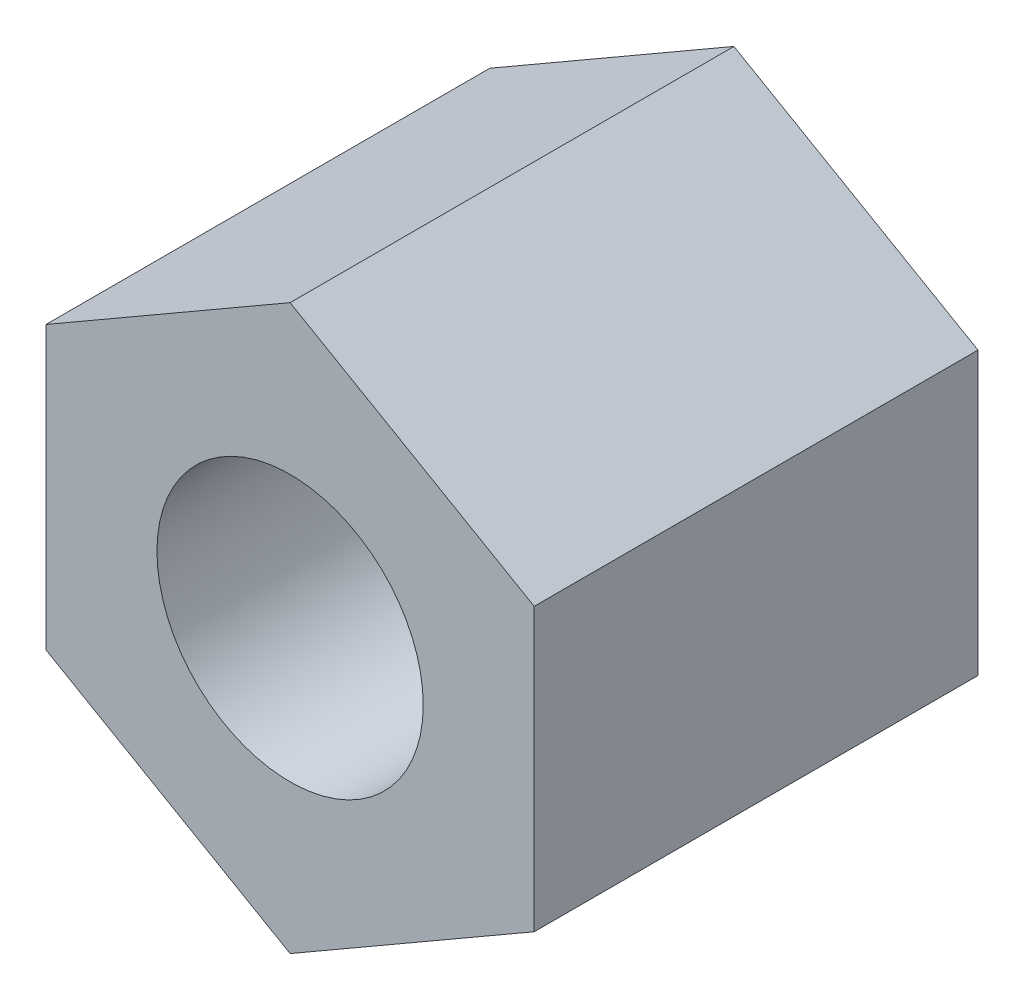
ISO-10303-21;
HEADER;
FILE_DESCRIPTION(('STEP AP214'),'2;1');
FILE_NAME('part.step','',(''),(''),'','','');
FILE_SCHEMA(('AUTOMOTIVE_DESIGN { 1 0 10303 214 1 1 1 1 }'));
ENDSEC;
DATA;
#1=APPLICATION_CONTEXT('core data for automotive mechanical design processes');
#2=APPLICATION_PROTOCOL_DEFINITION('international standard','automotive_design',2000,#1);
#3=PRODUCT_CONTEXT('',#1,'mechanical');
#4=PRODUCT('Part','Part','',(#3));
#5=PRODUCT_RELATED_PRODUCT_CATEGORY('part','',(#4));
#6=PRODUCT_DEFINITION_FORMATION('','',#4);
#7=PRODUCT_DEFINITION_CONTEXT('part definition',#1,'design');
#8=PRODUCT_DEFINITION('design','',#6,#7);
#9=PRODUCT_DEFINITION_SHAPE('','',#8);
#10=(LENGTH_UNIT() NAMED_UNIT(*) SI_UNIT(.MILLI.,.METRE.));
#11=(NAMED_UNIT(*) PLANE_ANGLE_UNIT() SI_UNIT($,.RADIAN.));
#12=(NAMED_UNIT(*) SI_UNIT($,.STERADIAN.) SOLID_ANGLE_UNIT());
#13=UNCERTAINTY_MEASURE_WITH_UNIT(LENGTH_MEASURE(1.E-05),#10,'distance_accuracy_value','');
#14=(GEOMETRIC_REPRESENTATION_CONTEXT(3) GLOBAL_UNCERTAINTY_ASSIGNED_CONTEXT((#13)) GLOBAL_UNIT_ASSIGNED_CONTEXT((#10,
#11,#12)) REPRESENTATION_CONTEXT('',''));
#15=CARTESIAN_POINT('',(0.,0.,0.));
#16=DIRECTION('',(0.,0.,1.));
#17=DIRECTION('',(1.,0.,0.));
#18=AXIS2_PLACEMENT_3D('',#15,#16,#17);
#19=CARTESIAN_POINT('',(0.,0.,5.));
#20=DIRECTION('',(0.,0.,1.));
#21=DIRECTION('',(1.,0.,0.));
#22=AXIS2_PLACEMENT_3D('',#19,#20,#21);
#23=PLANE('',#22);
#24=DIRECTION('',(0.866025403784442,-0.499999999999995,0.));
#25=VECTOR('',#24,1.);
#26=CARTESIAN_POINT('',(-2.74999999999998,-1.5877132402715,5.));
#27=LINE('',#26,#25);
#28=CARTESIAN_POINT('',(-2.74999999999998,-1.5877132402715,5.));
#29=VERTEX_POINT('',#28);
#30=CARTESIAN_POINT('',(0.,-3.17542648054294,5.));
#31=VERTEX_POINT('',#30);
#32=EDGE_CURVE('E146',#29,#31,#27,.T.);
#33=ORIENTED_EDGE('',*,*,#32,.T.);
#34=DIRECTION('',(0.866025403784438,0.500000000000001,0.));
#35=VECTOR('',#34,1.);
#36=CARTESIAN_POINT('',(0.,-3.17542648054294,5.));
#37=LINE('',#36,#35);
#38=CARTESIAN_POINT('',(2.75000000000001,-1.58771324027147,5.));
#39=VERTEX_POINT('',#38);
#40=EDGE_CURVE('E94',#31,#39,#37,.T.);
#41=ORIENTED_EDGE('',*,*,#40,.T.);
#42=DIRECTION('',(0.,1.,0.));
#43=VECTOR('',#42,1.);
#44=CARTESIAN_POINT('',(2.75000000000001,-1.58771324027147,5.));
#45=LINE('',#44,#43);
#46=CARTESIAN_POINT('',(2.74999999999999,1.58771324027148,5.));
#47=VERTEX_POINT('',#46);
#48=EDGE_CURVE('E107',#39,#47,#45,.T.);
#49=ORIENTED_EDGE('',*,*,#48,.T.);
#50=DIRECTION('',(-0.866025403784442,0.499999999999995,0.));
#51=VECTOR('',#50,1.);
#52=CARTESIAN_POINT('',(2.74999999999999,1.58771324027148,5.));
#53=LINE('',#52,#51);
#54=CARTESIAN_POINT('',(0.,3.17542648054294,5.));
#55=VERTEX_POINT('',#54);
#56=EDGE_CURVE('E101',#47,#55,#53,.T.);
#57=ORIENTED_EDGE('',*,*,#56,.T.);
#58=DIRECTION('',(-0.866025403784435,-0.500000000000007,0.));
#59=VECTOR('',#58,1.);
#60=CARTESIAN_POINT('',(0.,3.17542648054294,5.));
#61=LINE('',#60,#59);
#62=CARTESIAN_POINT('',(-2.75000000000002,1.58771324027145,5.));
#63=VERTEX_POINT('',#62);
#64=EDGE_CURVE('E105',#55,#63,#61,.T.);
#65=ORIENTED_EDGE('',*,*,#64,.T.);
#66=DIRECTION('',(0.,-1.,0.));
#67=VECTOR('',#66,1.);
#68=CARTESIAN_POINT('',(-2.75000000000002,1.58771324027145,5.));
#69=LINE('',#68,#67);
#70=EDGE_CURVE('E57',#63,#29,#69,.T.);
#71=ORIENTED_EDGE('',*,*,#70,.T.);
#72=EDGE_LOOP('',(#33,#41,#49,#57,#65,#71));
#73=FACE_BOUND('',#72,.T.);
#74=CARTESIAN_POINT('',(0.,0.,5.));
#75=DIRECTION('',(0.,0.,1.));
#76=DIRECTION('',(1.,0.,0.));
#77=AXIS2_PLACEMENT_3D('',#74,#75,#76);
#78=CIRCLE('',#77,1.5);
#79=CARTESIAN_POINT('',(1.5,0.,5.));
#80=VERTEX_POINT('',#79);
#81=EDGE_CURVE('E134',#80,#80,#78,.T.);
#82=ORIENTED_EDGE('',*,*,#81,.F.);
#83=EDGE_LOOP('',(#82));
#84=FACE_BOUND('',#83,.T.);
#85=ADVANCED_FACE('F39',(#73,#84),#23,.T.);
#86=CARTESIAN_POINT('',(0.,0.,0.));
#87=DIRECTION('',(0.,0.,1.));
#88=DIRECTION('',(1.,0.,0.));
#89=AXIS2_PLACEMENT_3D('',#86,#87,#88);
#90=PLANE('',#89);
#91=DIRECTION('',(0.866025403784442,-0.499999999999995,0.));
#92=VECTOR('',#91,1.);
#93=CARTESIAN_POINT('',(-2.74999999999998,-1.5877132402715,0.));
#94=LINE('',#93,#92);
#95=CARTESIAN_POINT('',(-2.74999999999998,-1.5877132402715,0.));
#96=VERTEX_POINT('',#95);
#97=CARTESIAN_POINT('',(0.,-3.17542648054294,0.));
#98=VERTEX_POINT('',#97);
#99=EDGE_CURVE('E129',#96,#98,#94,.T.);
#100=ORIENTED_EDGE('',*,*,#99,.F.);
#101=DIRECTION('',(0.,-1.,0.));
#102=VECTOR('',#101,1.);
#103=CARTESIAN_POINT('',(-2.75000000000002,1.58771324027145,0.));
#104=LINE('',#103,#102);
#105=CARTESIAN_POINT('',(-2.75000000000002,1.58771324027145,0.));
#106=VERTEX_POINT('',#105);
#107=EDGE_CURVE('E86',#106,#96,#104,.T.);
#108=ORIENTED_EDGE('',*,*,#107,.F.);
#109=DIRECTION('',(-0.866025403784435,-0.500000000000007,0.));
#110=VECTOR('',#109,1.);
#111=CARTESIAN_POINT('',(0.,3.17542648054294,0.));
#112=LINE('',#111,#110);
#113=CARTESIAN_POINT('',(0.,3.17542648054294,0.));
#114=VERTEX_POINT('',#113);
#115=EDGE_CURVE('E80',#114,#106,#112,.T.);
#116=ORIENTED_EDGE('',*,*,#115,.F.);
#117=DIRECTION('',(-0.866025403784442,0.499999999999995,0.));
#118=VECTOR('',#117,1.);
#119=CARTESIAN_POINT('',(2.74999999999999,1.58771324027148,0.));
#120=LINE('',#119,#118);
#121=CARTESIAN_POINT('',(2.74999999999999,1.58771324027148,0.));
#122=VERTEX_POINT('',#121);
#123=EDGE_CURVE('E116',#122,#114,#120,.T.);
#124=ORIENTED_EDGE('',*,*,#123,.F.);
#125=DIRECTION('',(0.,1.,0.));
#126=VECTOR('',#125,1.);
#127=CARTESIAN_POINT('',(2.75000000000001,-1.58771324027147,0.));
#128=LINE('',#127,#126);
#129=CARTESIAN_POINT('',(2.75000000000001,-1.58771324027147,0.));
#130=VERTEX_POINT('',#129);
#131=EDGE_CURVE('E137',#130,#122,#128,.T.);
#132=ORIENTED_EDGE('',*,*,#131,.F.);
#133=DIRECTION('',(0.866025403784438,0.500000000000001,0.));
#134=VECTOR('',#133,1.);
#135=CARTESIAN_POINT('',(0.,-3.17542648054294,0.));
#136=LINE('',#135,#134);
#137=EDGE_CURVE('E133',#98,#130,#136,.T.);
#138=ORIENTED_EDGE('',*,*,#137,.F.);
#139=EDGE_LOOP('',(#100,#108,#116,#124,#132,#138));
#140=FACE_BOUND('',#139,.T.);
#141=CARTESIAN_POINT('',(0.,0.,0.));
#142=DIRECTION('',(0.,0.,1.));
#143=DIRECTION('',(1.,0.,0.));
#144=AXIS2_PLACEMENT_3D('',#141,#142,#143);
#145=CIRCLE('',#144,1.5);
#146=CARTESIAN_POINT('',(1.5,0.,0.));
#147=VERTEX_POINT('',#146);
#148=EDGE_CURVE('E243',#147,#147,#145,.T.);
#149=ORIENTED_EDGE('',*,*,#148,.T.);
#150=EDGE_LOOP('',(#149));
#151=FACE_BOUND('',#150,.T.);
#152=ADVANCED_FACE('F159',(#140,#151),#90,.F.);
#153=CARTESIAN_POINT('',(-2.74999999999998,-1.5877132402715,5.));
#154=DIRECTION('',(0.499999999999995,0.866025403784442,0.));
#155=DIRECTION('',(-0.866025403784442,0.499999999999995,0.));
#156=AXIS2_PLACEMENT_3D('',#153,#154,#155);
#157=PLANE('',#156);
#158=ORIENTED_EDGE('',*,*,#99,.T.);
#159=DIRECTION('',(0.,0.,-1.));
#160=VECTOR('',#159,1.);
#161=CARTESIAN_POINT('',(0.,-3.17542648054294,5.));
#162=LINE('',#161,#160);
#163=EDGE_CURVE('E11',#31,#98,#162,.T.);
#164=ORIENTED_EDGE('',*,*,#163,.F.);
#165=ORIENTED_EDGE('',*,*,#32,.F.);
#166=DIRECTION('',(0.,0.,-1.));
#167=VECTOR('',#166,1.);
#168=CARTESIAN_POINT('',(-2.74999999999998,-1.5877132402715,5.));
#169=LINE('',#168,#167);
#170=EDGE_CURVE('E125',#29,#96,#169,.T.);
#171=ORIENTED_EDGE('',*,*,#170,.T.);
#172=EDGE_LOOP('',(#158,#164,#165,#171));
#173=FACE_BOUND('',#172,.T.);
#174=ADVANCED_FACE('F41',(#173),#157,.F.);
#175=CARTESIAN_POINT('',(0.,-3.17542648054294,5.));
#176=DIRECTION('',(-0.500000000000001,0.866025403784438,0.));
#177=DIRECTION('',(-0.866025403784438,-0.500000000000001,0.));
#178=AXIS2_PLACEMENT_3D('',#175,#176,#177);
#179=PLANE('',#178);
#180=ORIENTED_EDGE('',*,*,#137,.T.);
#181=DIRECTION('',(0.,0.,-1.));
#182=VECTOR('',#181,1.);
#183=CARTESIAN_POINT('',(2.75000000000001,-1.58771324027147,5.));
#184=LINE('',#183,#182);
#185=EDGE_CURVE('E49',#39,#130,#184,.T.);
#186=ORIENTED_EDGE('',*,*,#185,.F.);
#187=ORIENTED_EDGE('',*,*,#40,.F.);
#188=ORIENTED_EDGE('',*,*,#163,.T.);
#189=EDGE_LOOP('',(#180,#186,#187,#188));
#190=FACE_BOUND('',#189,.T.);
#191=ADVANCED_FACE('F184',(#190),#179,.F.);
#192=CARTESIAN_POINT('',(2.75000000000001,-1.58771324027147,5.));
#193=DIRECTION('',(-1.,0.,0.));
#194=DIRECTION('',(0.,-1.,0.));
#195=AXIS2_PLACEMENT_3D('',#192,#193,#194);
#196=PLANE('',#195);
#197=ORIENTED_EDGE('',*,*,#131,.T.);
#198=DIRECTION('',(0.,0.,-1.));
#199=VECTOR('',#198,1.);
#200=CARTESIAN_POINT('',(2.74999999999999,1.58771324027148,5.));
#201=LINE('',#200,#199);
#202=EDGE_CURVE('E118',#47,#122,#201,.T.);
#203=ORIENTED_EDGE('',*,*,#202,.F.);
#204=ORIENTED_EDGE('',*,*,#48,.F.);
#205=ORIENTED_EDGE('',*,*,#185,.T.);
#206=EDGE_LOOP('',(#197,#203,#204,#205));
#207=FACE_BOUND('',#206,.T.);
#208=ADVANCED_FACE('F156',(#207),#196,.F.);
#209=CARTESIAN_POINT('',(2.74999999999999,1.58771324027148,5.));
#210=DIRECTION('',(-0.499999999999995,-0.866025403784442,0.));
#211=DIRECTION('',(0.866025403784442,-0.499999999999995,0.));
#212=AXIS2_PLACEMENT_3D('',#209,#210,#211);
#213=PLANE('',#212);
#214=ORIENTED_EDGE('',*,*,#123,.T.);
#215=DIRECTION('',(0.,0.,-1.));
#216=VECTOR('',#215,1.);
#217=CARTESIAN_POINT('',(0.,3.17542648054294,5.));
#218=LINE('',#217,#216);
#219=EDGE_CURVE('E113',#55,#114,#218,.T.);
#220=ORIENTED_EDGE('',*,*,#219,.F.);
#221=ORIENTED_EDGE('',*,*,#56,.F.);
#222=ORIENTED_EDGE('',*,*,#202,.T.);
#223=EDGE_LOOP('',(#214,#220,#221,#222));
#224=FACE_BOUND('',#223,.T.);
#225=ADVANCED_FACE('F114',(#224),#213,.F.);
#226=CARTESIAN_POINT('',(0.,3.17542648054294,5.));
#227=DIRECTION('',(0.500000000000007,-0.866025403784435,0.));
#228=DIRECTION('',(0.866025403784435,0.500000000000007,0.));
#229=AXIS2_PLACEMENT_3D('',#226,#227,#228);
#230=PLANE('',#229);
#231=ORIENTED_EDGE('',*,*,#115,.T.);
#232=DIRECTION('',(0.,0.,-1.));
#233=VECTOR('',#232,1.);
#234=CARTESIAN_POINT('',(-2.75000000000002,1.58771324027145,5.));
#235=LINE('',#234,#233);
#236=EDGE_CURVE('E119',#63,#106,#235,.T.);
#237=ORIENTED_EDGE('',*,*,#236,.F.);
#238=ORIENTED_EDGE('',*,*,#64,.F.);
#239=ORIENTED_EDGE('',*,*,#219,.T.);
#240=EDGE_LOOP('',(#231,#237,#238,#239));
#241=FACE_BOUND('',#240,.T.);
#242=ADVANCED_FACE('F121',(#241),#230,.F.);
#243=CARTESIAN_POINT('',(-2.75000000000002,1.58771324027145,5.));
#244=DIRECTION('',(1.,0.,0.));
#245=DIRECTION('',(0.,1.,0.));
#246=AXIS2_PLACEMENT_3D('',#243,#244,#245);
#247=PLANE('',#246);
#248=ORIENTED_EDGE('',*,*,#107,.T.);
#249=ORIENTED_EDGE('',*,*,#170,.F.);
#250=ORIENTED_EDGE('',*,*,#70,.F.);
#251=ORIENTED_EDGE('',*,*,#236,.T.);
#252=EDGE_LOOP('',(#248,#249,#250,#251));
#253=FACE_BOUND('',#252,.T.);
#254=ADVANCED_FACE('F164',(#253),#247,.F.);
#255=CARTESIAN_POINT('',(0.,0.,5.));
#256=DIRECTION('',(0.,0.,-1.));
#257=DIRECTION('',(-1.,0.,0.));
#258=AXIS2_PLACEMENT_3D('',#255,#256,#257);
#259=CYLINDRICAL_SURFACE('',#258,1.5);
#260=ORIENTED_EDGE('',*,*,#81,.T.);
#261=EDGE_LOOP('',(#260));
#262=FACE_BOUND('',#261,.T.);
#263=ORIENTED_EDGE('',*,*,#148,.F.);
#264=EDGE_LOOP('',(#263));
#265=FACE_BOUND('',#264,.T.);
#266=ADVANCED_FACE('F166',(#262,#265),#259,.F.);
#267=CLOSED_SHELL('',(#85,#152,#174,#191,#208,#225,#242,#254,#266));
#268=MANIFOLD_SOLID_BREP('B2',#267);
#269=ADVANCED_BREP_SHAPE_REPRESENTATION('',(#18,#268),#14);
#270=SHAPE_DEFINITION_REPRESENTATION(#9,#269);
ENDSEC;
END-ISO-10303-21;
